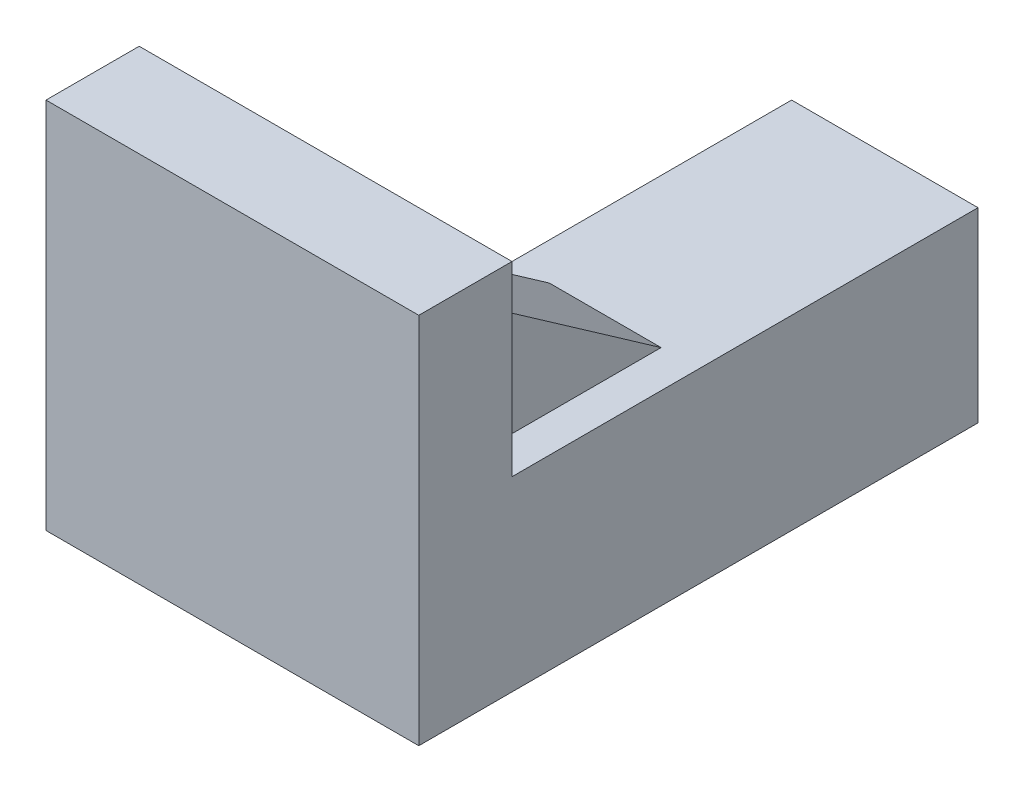
ISO-10303-21;
HEADER;
FILE_DESCRIPTION(('STEP AP214'),'2;1');
FILE_NAME('part.step','',(''),(''),'','','');
FILE_SCHEMA(('AUTOMOTIVE_DESIGN { 1 0 10303 214 1 1 1 1 }'));
ENDSEC;
DATA;
#1=APPLICATION_CONTEXT('core data for automotive mechanical design processes');
#2=APPLICATION_PROTOCOL_DEFINITION('international standard','automotive_design',2000,#1);
#3=PRODUCT_CONTEXT('',#1,'mechanical');
#4=PRODUCT('Part','Part','',(#3));
#5=PRODUCT_RELATED_PRODUCT_CATEGORY('part','',(#4));
#6=PRODUCT_DEFINITION_FORMATION('','',#4);
#7=PRODUCT_DEFINITION_CONTEXT('part definition',#1,'design');
#8=PRODUCT_DEFINITION('design','',#6,#7);
#9=PRODUCT_DEFINITION_SHAPE('','',#8);
#10=(LENGTH_UNIT() NAMED_UNIT(*) SI_UNIT(.MILLI.,.METRE.));
#11=(NAMED_UNIT(*) PLANE_ANGLE_UNIT() SI_UNIT($,.RADIAN.));
#12=(NAMED_UNIT(*) SI_UNIT($,.STERADIAN.) SOLID_ANGLE_UNIT());
#13=UNCERTAINTY_MEASURE_WITH_UNIT(LENGTH_MEASURE(1.E-05),#10,'distance_accuracy_value','');
#14=(GEOMETRIC_REPRESENTATION_CONTEXT(3) GLOBAL_UNCERTAINTY_ASSIGNED_CONTEXT((#13)) GLOBAL_UNIT_ASSIGNED_CONTEXT((#10,
#11,#12)) REPRESENTATION_CONTEXT('',''));
#15=CARTESIAN_POINT('',(0.,0.,0.));
#16=DIRECTION('',(0.,0.,1.));
#17=DIRECTION('',(1.,0.,0.));
#18=AXIS2_PLACEMENT_3D('',#15,#16,#17);
#19=CARTESIAN_POINT('',(0.,0.,25.));
#20=DIRECTION('',(1.,0.,0.));
#21=DIRECTION('',(0.,0.,-1.));
#22=AXIS2_PLACEMENT_3D('',#19,#20,#21);
#23=PLANE('',#22);
#24=DIRECTION('',(0.,0.,1.));
#25=VECTOR('',#24,1.);
#26=CARTESIAN_POINT('',(0.,2.,15.));
#27=LINE('',#26,#25);
#28=CARTESIAN_POINT('',(0.,2.,15.));
#29=VERTEX_POINT('',#28);
#30=CARTESIAN_POINT('',(0.,2.,25.));
#31=VERTEX_POINT('',#30);
#32=EDGE_CURVE('E59',#29,#31,#27,.T.);
#33=ORIENTED_EDGE('',*,*,#32,.F.);
#34=DIRECTION('',(0.,-1.,0.));
#35=VECTOR('',#34,1.);
#36=CARTESIAN_POINT('',(0.,0.,15.));
#37=LINE('',#36,#35);
#38=CARTESIAN_POINT('',(0.,8.,15.));
#39=VERTEX_POINT('',#38);
#40=EDGE_CURVE('E158',#39,#29,#37,.T.);
#41=ORIENTED_EDGE('',*,*,#40,.F.);
#42=DIRECTION('',(0.,0.,1.));
#43=VECTOR('',#42,1.);
#44=CARTESIAN_POINT('',(0.,8.,15.));
#45=LINE('',#44,#43);
#46=CARTESIAN_POINT('',(0.,8.,25.));
#47=VERTEX_POINT('',#46);
#48=EDGE_CURVE('E166',#39,#47,#45,.T.);
#49=ORIENTED_EDGE('',*,*,#48,.T.);
#50=DIRECTION('',(0.,-1.,0.));
#51=VECTOR('',#50,1.);
#52=CARTESIAN_POINT('',(0.,0.,25.));
#53=LINE('',#52,#51);
#54=CARTESIAN_POINT('',(0.,10.,25.));
#55=VERTEX_POINT('',#54);
#56=EDGE_CURVE('E203',#55,#47,#53,.T.);
#57=ORIENTED_EDGE('',*,*,#56,.F.);
#58=DIRECTION('',(0.,0.,-1.));
#59=VECTOR('',#58,1.);
#60=CARTESIAN_POINT('',(0.,10.,25.));
#61=LINE('',#60,#59);
#62=CARTESIAN_POINT('',(0.,10.,0.));
#63=VERTEX_POINT('',#62);
#64=EDGE_CURVE('E210',#55,#63,#61,.T.);
#65=ORIENTED_EDGE('',*,*,#64,.T.);
#66=DIRECTION('',(0.,-1.,0.));
#67=VECTOR('',#66,1.);
#68=CARTESIAN_POINT('',(0.,0.,0.));
#69=LINE('',#68,#67);
#70=CARTESIAN_POINT('',(0.,0.,0.));
#71=VERTEX_POINT('',#70);
#72=EDGE_CURVE('E200',#63,#71,#69,.T.);
#73=ORIENTED_EDGE('',*,*,#72,.T.);
#74=DIRECTION('',(0.,0.,-1.));
#75=VECTOR('',#74,1.);
#76=CARTESIAN_POINT('',(0.,0.,25.));
#77=LINE('',#76,#75);
#78=CARTESIAN_POINT('',(0.,0.,25.));
#79=VERTEX_POINT('',#78);
#80=EDGE_CURVE('E11',#79,#71,#77,.T.);
#81=ORIENTED_EDGE('',*,*,#80,.F.);
#82=EDGE_CURVE('E206',#31,#79,#53,.T.);
#83=ORIENTED_EDGE('',*,*,#82,.F.);
#84=EDGE_LOOP('',(#33,#41,#49,#57,#65,#73,#81,#83));
#85=FACE_BOUND('',#84,.T.);
#86=ADVANCED_FACE('F37',(#85),#23,.F.);
#87=CARTESIAN_POINT('',(0.,0.,25.));
#88=DIRECTION('',(0.,0.,1.));
#89=DIRECTION('',(1.,0.,0.));
#90=AXIS2_PLACEMENT_3D('',#87,#88,#89);
#91=PLANE('',#90);
#92=DIRECTION('',(0.,-1.,0.));
#93=VECTOR('',#92,1.);
#94=CARTESIAN_POINT('',(8.,0.,25.));
#95=LINE('',#94,#93);
#96=CARTESIAN_POINT('',(8.,17.,25.));
#97=VERTEX_POINT('',#96);
#98=CARTESIAN_POINT('',(8.,10.,25.));
#99=VERTEX_POINT('',#98);
#100=EDGE_CURVE('E139',#97,#99,#95,.T.);
#101=ORIENTED_EDGE('',*,*,#100,.F.);
#102=DIRECTION('',(-1.,0.,0.));
#103=VECTOR('',#102,1.);
#104=CARTESIAN_POINT('',(0.,17.,25.));
#105=LINE('',#104,#103);
#106=CARTESIAN_POINT('',(2.,17.,25.));
#107=VERTEX_POINT('',#106);
#108=EDGE_CURVE('E247',#97,#107,#105,.T.);
#109=ORIENTED_EDGE('',*,*,#108,.T.);
#110=DIRECTION('',(0.,-1.,0.));
#111=VECTOR('',#110,1.);
#112=CARTESIAN_POINT('',(2.,0.,25.));
#113=LINE('',#112,#111);
#114=CARTESIAN_POINT('',(2.,10.,25.));
#115=VERTEX_POINT('',#114);
#116=EDGE_CURVE('E144',#107,#115,#113,.T.);
#117=ORIENTED_EDGE('',*,*,#116,.T.);
#118=DIRECTION('',(-1.,0.,0.));
#119=VECTOR('',#118,1.);
#120=CARTESIAN_POINT('',(0.,10.,25.));
#121=LINE('',#120,#119);
#122=EDGE_CURVE('E150',#115,#55,#121,.T.);
#123=ORIENTED_EDGE('',*,*,#122,.T.);
#124=ORIENTED_EDGE('',*,*,#56,.T.);
#125=DIRECTION('',(1.,0.,0.));
#126=VECTOR('',#125,1.);
#127=CARTESIAN_POINT('',(0.,8.,25.));
#128=LINE('',#127,#126);
#129=CARTESIAN_POINT('',(-7.,8.,25.));
#130=VERTEX_POINT('',#129);
#131=EDGE_CURVE('E162',#130,#47,#128,.T.);
#132=ORIENTED_EDGE('',*,*,#131,.F.);
#133=DIRECTION('',(0.,1.,0.));
#134=VECTOR('',#133,1.);
#135=CARTESIAN_POINT('',(-7.,0.,25.));
#136=LINE('',#135,#134);
#137=CARTESIAN_POINT('',(-7.,2.,25.));
#138=VERTEX_POINT('',#137);
#139=EDGE_CURVE('E153',#138,#130,#136,.T.);
#140=ORIENTED_EDGE('',*,*,#139,.F.);
#141=DIRECTION('',(1.,0.,0.));
#142=VECTOR('',#141,1.);
#143=CARTESIAN_POINT('',(0.,2.,25.));
#144=LINE('',#143,#142);
#145=EDGE_CURVE('E160',#138,#31,#144,.T.);
#146=ORIENTED_EDGE('',*,*,#145,.T.);
#147=ORIENTED_EDGE('',*,*,#82,.T.);
#148=DIRECTION('',(1.,0.,0.));
#149=VECTOR('',#148,1.);
#150=CARTESIAN_POINT('',(10.,0.,25.));
#151=LINE('',#150,#149);
#152=CARTESIAN_POINT('',(-10.,0.,25.));
#153=VERTEX_POINT('',#152);
#154=EDGE_CURVE('E174',#153,#79,#151,.T.);
#155=ORIENTED_EDGE('',*,*,#154,.F.);
#156=DIRECTION('',(0.,-1.,0.));
#157=VECTOR('',#156,1.);
#158=CARTESIAN_POINT('',(-10.,0.,25.));
#159=LINE('',#158,#157);
#160=CARTESIAN_POINT('',(-10.,20.,25.));
#161=VERTEX_POINT('',#160);
#162=EDGE_CURVE('E185',#161,#153,#159,.T.);
#163=ORIENTED_EDGE('',*,*,#162,.F.);
#164=DIRECTION('',(-1.,0.,0.));
#165=VECTOR('',#164,1.);
#166=CARTESIAN_POINT('',(10.,20.,25.));
#167=LINE('',#166,#165);
#168=CARTESIAN_POINT('',(10.,20.,25.));
#169=VERTEX_POINT('',#168);
#170=EDGE_CURVE('E183',#169,#161,#167,.T.);
#171=ORIENTED_EDGE('',*,*,#170,.F.);
#172=DIRECTION('',(0.,1.,0.));
#173=VECTOR('',#172,1.);
#174=CARTESIAN_POINT('',(10.,0.,25.));
#175=LINE('',#174,#173);
#176=CARTESIAN_POINT('',(10.,10.,25.));
#177=VERTEX_POINT('',#176);
#178=EDGE_CURVE('E169',#177,#169,#175,.T.);
#179=ORIENTED_EDGE('',*,*,#178,.F.);
#180=EDGE_CURVE('E207',#177,#99,#121,.T.);
#181=ORIENTED_EDGE('',*,*,#180,.T.);
#182=EDGE_LOOP('',(#101,#109,#117,#123,#124,#132,#140,#146,#147,#155,#163,#171,#179,#181));
#183=FACE_BOUND('',#182,.T.);
#184=ADVANCED_FACE('F245',(#183),#91,.F.);
#185=CARTESIAN_POINT('',(0.,0.,25.));
#186=DIRECTION('',(0.,1.,0.));
#187=DIRECTION('',(0.,0.,1.));
#188=AXIS2_PLACEMENT_3D('',#185,#186,#187);
#189=PLANE('',#188);
#190=DIRECTION('',(1.,0.,0.));
#191=VECTOR('',#190,1.);
#192=CARTESIAN_POINT('',(0.,0.,0.));
#193=LINE('',#192,#191);
#194=CARTESIAN_POINT('',(10.,0.,0.));
#195=VERTEX_POINT('',#194);
#196=EDGE_CURVE('E213',#71,#195,#193,.T.);
#197=ORIENTED_EDGE('',*,*,#196,.T.);
#198=DIRECTION('',(0.,0.,-1.));
#199=VECTOR('',#198,1.);
#200=CARTESIAN_POINT('',(10.,0.,25.));
#201=LINE('',#200,#199);
#202=CARTESIAN_POINT('',(10.,0.,30.));
#203=VERTEX_POINT('',#202);
#204=EDGE_CURVE('E44',#203,#195,#201,.T.);
#205=ORIENTED_EDGE('',*,*,#204,.F.);
#206=DIRECTION('',(1.,0.,0.));
#207=VECTOR('',#206,1.);
#208=CARTESIAN_POINT('',(10.,0.,30.));
#209=LINE('',#208,#207);
#210=CARTESIAN_POINT('',(-10.,0.,30.));
#211=VERTEX_POINT('',#210);
#212=EDGE_CURVE('E178',#211,#203,#209,.T.);
#213=ORIENTED_EDGE('',*,*,#212,.F.);
#214=DIRECTION('',(0.,0.,-1.));
#215=VECTOR('',#214,1.);
#216=CARTESIAN_POINT('',(-10.,0.,30.));
#217=LINE('',#216,#215);
#218=EDGE_CURVE('E181',#211,#153,#217,.T.);
#219=ORIENTED_EDGE('',*,*,#218,.T.);
#220=ORIENTED_EDGE('',*,*,#154,.T.);
#221=ORIENTED_EDGE('',*,*,#80,.T.);
#222=EDGE_LOOP('',(#197,#205,#213,#219,#220,#221));
#223=FACE_BOUND('',#222,.T.);
#224=ADVANCED_FACE('F266',(#223),#189,.F.);
#225=CARTESIAN_POINT('',(10.,0.,25.));
#226=DIRECTION('',(-1.,0.,0.));
#227=DIRECTION('',(0.,0.,1.));
#228=AXIS2_PLACEMENT_3D('',#225,#226,#227);
#229=PLANE('',#228);
#230=DIRECTION('',(0.,1.,0.));
#231=VECTOR('',#230,1.);
#232=CARTESIAN_POINT('',(10.,0.,0.));
#233=LINE('',#232,#231);
#234=CARTESIAN_POINT('',(10.,10.,0.));
#235=VERTEX_POINT('',#234);
#236=EDGE_CURVE('E215',#195,#235,#233,.T.);
#237=ORIENTED_EDGE('',*,*,#236,.T.);
#238=DIRECTION('',(0.,0.,-1.));
#239=VECTOR('',#238,1.);
#240=CARTESIAN_POINT('',(10.,10.,25.));
#241=LINE('',#240,#239);
#242=EDGE_CURVE('E222',#177,#235,#241,.T.);
#243=ORIENTED_EDGE('',*,*,#242,.F.);
#244=ORIENTED_EDGE('',*,*,#178,.T.);
#245=DIRECTION('',(0.,0.,-1.));
#246=VECTOR('',#245,1.);
#247=CARTESIAN_POINT('',(10.,20.,30.));
#248=LINE('',#247,#246);
#249=CARTESIAN_POINT('',(10.,20.,30.));
#250=VERTEX_POINT('',#249);
#251=EDGE_CURVE('E193',#250,#169,#248,.T.);
#252=ORIENTED_EDGE('',*,*,#251,.F.);
#253=DIRECTION('',(0.,1.,0.));
#254=VECTOR('',#253,1.);
#255=CARTESIAN_POINT('',(10.,0.,30.));
#256=LINE('',#255,#254);
#257=EDGE_CURVE('E170',#203,#250,#256,.T.);
#258=ORIENTED_EDGE('',*,*,#257,.F.);
#259=ORIENTED_EDGE('',*,*,#204,.T.);
#260=EDGE_LOOP('',(#237,#243,#244,#252,#258,#259));
#261=FACE_BOUND('',#260,.T.);
#262=ADVANCED_FACE('F227',(#261),#229,.F.);
#263=CARTESIAN_POINT('',(0.,10.,25.));
#264=DIRECTION('',(0.,-1.,0.));
#265=DIRECTION('',(0.,0.,-1.));
#266=AXIS2_PLACEMENT_3D('',#263,#264,#265);
#267=PLANE('',#266);
#268=ORIENTED_EDGE('',*,*,#242,.T.);
#269=DIRECTION('',(-1.,0.,0.));
#270=VECTOR('',#269,1.);
#271=CARTESIAN_POINT('',(0.,10.,0.));
#272=LINE('',#271,#270);
#273=EDGE_CURVE('E218',#235,#63,#272,.T.);
#274=ORIENTED_EDGE('',*,*,#273,.T.);
#275=ORIENTED_EDGE('',*,*,#64,.F.);
#276=ORIENTED_EDGE('',*,*,#122,.F.);
#277=DIRECTION('',(0.,0.,1.));
#278=VECTOR('',#277,1.);
#279=CARTESIAN_POINT('',(2.,10.,15.));
#280=LINE('',#279,#278);
#281=CARTESIAN_POINT('',(2.,10.,15.));
#282=VERTEX_POINT('',#281);
#283=EDGE_CURVE('E138',#282,#115,#280,.T.);
#284=ORIENTED_EDGE('',*,*,#283,.F.);
#285=DIRECTION('',(-1.,0.,0.));
#286=VECTOR('',#285,1.);
#287=CARTESIAN_POINT('',(0.,10.,15.));
#288=LINE('',#287,#286);
#289=CARTESIAN_POINT('',(8.,10.,15.));
#290=VERTEX_POINT('',#289);
#291=EDGE_CURVE('E130',#290,#282,#288,.T.);
#292=ORIENTED_EDGE('',*,*,#291,.F.);
#293=DIRECTION('',(0.,0.,1.));
#294=VECTOR('',#293,1.);
#295=CARTESIAN_POINT('',(8.,10.,15.));
#296=LINE('',#295,#294);
#297=EDGE_CURVE('E151',#290,#99,#296,.T.);
#298=ORIENTED_EDGE('',*,*,#297,.T.);
#299=ORIENTED_EDGE('',*,*,#180,.F.);
#300=EDGE_LOOP('',(#268,#274,#275,#276,#284,#292,#298,#299));
#301=FACE_BOUND('',#300,.T.);
#302=ADVANCED_FACE('F148',(#301),#267,.F.);
#303=CARTESIAN_POINT('',(0.,0.,0.));
#304=DIRECTION('',(0.,0.,-1.));
#305=DIRECTION('',(-1.,0.,0.));
#306=AXIS2_PLACEMENT_3D('',#303,#304,#305);
#307=PLANE('',#306);
#308=CARTESIAN_POINT('',(5.70710678118655,4.29289321881345,0.));
#309=DIRECTION('',(0.,0.,-1.));
#310=DIRECTION('',(-1.,0.,0.));
#311=AXIS2_PLACEMENT_3D('',#308,#309,#310);
#312=CIRCLE('',#311,1.5);
#313=CARTESIAN_POINT('',(4.20710678118655,4.29289321881345,0.));
#314=VERTEX_POINT('',#313);
#315=EDGE_CURVE('E196',#314,#314,#312,.T.);
#316=ORIENTED_EDGE('',*,*,#315,.F.);
#317=EDGE_LOOP('',(#316));
#318=FACE_BOUND('',#317,.T.);
#319=ORIENTED_EDGE('',*,*,#72,.F.);
#320=ORIENTED_EDGE('',*,*,#273,.F.);
#321=ORIENTED_EDGE('',*,*,#236,.F.);
#322=ORIENTED_EDGE('',*,*,#196,.F.);
#323=EDGE_LOOP('',(#319,#320,#321,#322));
#324=FACE_BOUND('',#323,.T.);
#325=ADVANCED_FACE('F235',(#318,#324),#307,.T.);
#326=CARTESIAN_POINT('',(5.70710678118655,4.29289321881345,15.));
#327=DIRECTION('',(0.,0.,-1.));
#328=DIRECTION('',(-1.,0.,0.));
#329=AXIS2_PLACEMENT_3D('',#326,#327,#328);
#330=CYLINDRICAL_SURFACE('',#329,1.5);
#331=CARTESIAN_POINT('',(5.70710678118655,4.29289321881345,15.));
#332=DIRECTION('',(0.,0.,-1.));
#333=DIRECTION('',(-1.,0.,0.));
#334=AXIS2_PLACEMENT_3D('',#331,#332,#333);
#335=CIRCLE('',#334,1.5);
#336=CARTESIAN_POINT('',(4.20710678118655,4.29289321881345,15.));
#337=VERTEX_POINT('',#336);
#338=EDGE_CURVE('E197',#337,#337,#335,.T.);
#339=ORIENTED_EDGE('',*,*,#338,.F.);
#340=EDGE_LOOP('',(#339));
#341=FACE_BOUND('',#340,.T.);
#342=ORIENTED_EDGE('',*,*,#315,.T.);
#343=EDGE_LOOP('',(#342));
#344=FACE_BOUND('',#343,.T.);
#345=ADVANCED_FACE('F302',(#341,#344),#330,.F.);
#346=CARTESIAN_POINT('',(5.70710678118655,4.29289321881345,15.));
#347=DIRECTION('',(0.,0.,-1.));
#348=DIRECTION('',(-1.,0.,0.));
#349=AXIS2_PLACEMENT_3D('',#346,#347,#348);
#350=PLANE('',#349);
#351=ORIENTED_EDGE('',*,*,#338,.T.);
#352=EDGE_LOOP('',(#351));
#353=FACE_BOUND('',#352,.T.);
#354=ADVANCED_FACE('F299',(#353),#350,.T.);
#355=CARTESIAN_POINT('',(10.,20.,30.));
#356=DIRECTION('',(0.,-1.,0.));
#357=DIRECTION('',(0.,0.,-1.));
#358=AXIS2_PLACEMENT_3D('',#355,#356,#357);
#359=PLANE('',#358);
#360=ORIENTED_EDGE('',*,*,#170,.T.);
#361=DIRECTION('',(0.,0.,-1.));
#362=VECTOR('',#361,1.);
#363=CARTESIAN_POINT('',(-10.,20.,30.));
#364=LINE('',#363,#362);
#365=CARTESIAN_POINT('',(-10.,20.,30.));
#366=VERTEX_POINT('',#365);
#367=EDGE_CURVE('E190',#366,#161,#364,.T.);
#368=ORIENTED_EDGE('',*,*,#367,.F.);
#369=DIRECTION('',(-1.,0.,0.));
#370=VECTOR('',#369,1.);
#371=CARTESIAN_POINT('',(10.,20.,30.));
#372=LINE('',#371,#370);
#373=EDGE_CURVE('E173',#250,#366,#372,.T.);
#374=ORIENTED_EDGE('',*,*,#373,.F.);
#375=ORIENTED_EDGE('',*,*,#251,.T.);
#376=EDGE_LOOP('',(#360,#368,#374,#375));
#377=FACE_BOUND('',#376,.T.);
#378=ADVANCED_FACE('F260',(#377),#359,.F.);
#379=CARTESIAN_POINT('',(-10.,0.,30.));
#380=DIRECTION('',(1.,0.,0.));
#381=DIRECTION('',(0.,0.,-1.));
#382=AXIS2_PLACEMENT_3D('',#379,#380,#381);
#383=PLANE('',#382);
#384=ORIENTED_EDGE('',*,*,#162,.T.);
#385=ORIENTED_EDGE('',*,*,#218,.F.);
#386=DIRECTION('',(0.,-1.,0.));
#387=VECTOR('',#386,1.);
#388=CARTESIAN_POINT('',(-10.,0.,30.));
#389=LINE('',#388,#387);
#390=EDGE_CURVE('E176',#366,#211,#389,.T.);
#391=ORIENTED_EDGE('',*,*,#390,.F.);
#392=ORIENTED_EDGE('',*,*,#367,.T.);
#393=EDGE_LOOP('',(#384,#385,#391,#392));
#394=FACE_BOUND('',#393,.T.);
#395=ADVANCED_FACE('F284',(#394),#383,.F.);
#396=CARTESIAN_POINT('',(0.,0.,30.));
#397=DIRECTION('',(0.,0.,1.));
#398=DIRECTION('',(1.,0.,0.));
#399=AXIS2_PLACEMENT_3D('',#396,#397,#398);
#400=PLANE('',#399);
#401=ORIENTED_EDGE('',*,*,#257,.T.);
#402=ORIENTED_EDGE('',*,*,#373,.T.);
#403=ORIENTED_EDGE('',*,*,#390,.T.);
#404=ORIENTED_EDGE('',*,*,#212,.T.);
#405=EDGE_LOOP('',(#401,#402,#403,#404));
#406=FACE_BOUND('',#405,.T.);
#407=ADVANCED_FACE('F264',(#406),#400,.T.);
#408=CARTESIAN_POINT('',(0.,8.,15.));
#409=DIRECTION('',(0.,-1.,0.));
#410=DIRECTION('',(0.,0.,-1.));
#411=AXIS2_PLACEMENT_3D('',#408,#409,#410);
#412=PLANE('',#411);
#413=ORIENTED_EDGE('',*,*,#48,.F.);
#414=DIRECTION('',(0.573462344363328,0.,-0.81923192051904));
#415=VECTOR('',#414,1.);
#416=CARTESIAN_POINT('',(-7.,8.,25.));
#417=LINE('',#416,#415);
#418=EDGE_CURVE('E250',#130,#39,#417,.T.);
#419=ORIENTED_EDGE('',*,*,#418,.F.);
#420=ORIENTED_EDGE('',*,*,#131,.T.);
#421=EDGE_LOOP('',(#413,#419,#420));
#422=FACE_BOUND('',#421,.T.);
#423=ADVANCED_FACE('F276',(#422),#412,.F.);
#424=CARTESIAN_POINT('',(0.,2.,15.));
#425=DIRECTION('',(0.,-1.,0.));
#426=DIRECTION('',(0.,0.,-1.));
#427=AXIS2_PLACEMENT_3D('',#424,#425,#426);
#428=PLANE('',#427);
#429=DIRECTION('',(-0.573462344363328,0.,0.81923192051904));
#430=VECTOR('',#429,1.);
#431=CARTESIAN_POINT('',(0.,2.,15.));
#432=LINE('',#431,#430);
#433=EDGE_CURVE('E248',#29,#138,#432,.T.);
#434=ORIENTED_EDGE('',*,*,#433,.F.);
#435=ORIENTED_EDGE('',*,*,#32,.T.);
#436=ORIENTED_EDGE('',*,*,#145,.F.);
#437=EDGE_LOOP('',(#434,#435,#436));
#438=FACE_BOUND('',#437,.T.);
#439=ADVANCED_FACE('F274',(#438),#428,.T.);
#440=CARTESIAN_POINT('',(2.,0.,15.));
#441=DIRECTION('',(-1.,0.,0.));
#442=DIRECTION('',(0.,0.,1.));
#443=AXIS2_PLACEMENT_3D('',#440,#441,#442);
#444=PLANE('',#443);
#445=DIRECTION('',(0.,0.573462344363328,0.81923192051904));
#446=VECTOR('',#445,1.);
#447=CARTESIAN_POINT('',(2.,10.,15.));
#448=LINE('',#447,#446);
#449=EDGE_CURVE('E133',#282,#107,#448,.T.);
#450=ORIENTED_EDGE('',*,*,#449,.F.);
#451=ORIENTED_EDGE('',*,*,#283,.T.);
#452=ORIENTED_EDGE('',*,*,#116,.F.);
#453=EDGE_LOOP('',(#450,#451,#452));
#454=FACE_BOUND('',#453,.T.);
#455=ADVANCED_FACE('F142',(#454),#444,.T.);
#456=CARTESIAN_POINT('',(8.,0.,15.));
#457=DIRECTION('',(-1.,0.,0.));
#458=DIRECTION('',(0.,0.,1.));
#459=AXIS2_PLACEMENT_3D('',#456,#457,#458);
#460=PLANE('',#459);
#461=ORIENTED_EDGE('',*,*,#297,.F.);
#462=DIRECTION('',(0.,0.573462344363328,0.81923192051904));
#463=VECTOR('',#462,1.);
#464=CARTESIAN_POINT('',(8.,6.71140939597315,10.3020134228188));
#465=LINE('',#464,#463);
#466=EDGE_CURVE('E51',#290,#97,#465,.T.);
#467=ORIENTED_EDGE('',*,*,#466,.T.);
#468=ORIENTED_EDGE('',*,*,#100,.T.);
#469=EDGE_LOOP('',(#461,#467,#468));
#470=FACE_BOUND('',#469,.T.);
#471=ADVANCED_FACE('F255',(#470),#460,.F.);
#472=CARTESIAN_POINT('',(-7.,-2.,25.));
#473=DIRECTION('',(0.81923192051904,0.,0.573462344363328));
#474=DIRECTION('',(0.573462344363328,0.,-0.81923192051904));
#475=AXIS2_PLACEMENT_3D('',#472,#473,#474);
#476=PLANE('',#475);
#477=ORIENTED_EDGE('',*,*,#433,.T.);
#478=ORIENTED_EDGE('',*,*,#139,.T.);
#479=ORIENTED_EDGE('',*,*,#418,.T.);
#480=ORIENTED_EDGE('',*,*,#40,.T.);
#481=EDGE_LOOP('',(#477,#478,#479,#480));
#482=FACE_BOUND('',#481,.T.);
#483=ADVANCED_FACE('F272',(#482),#476,.F.);
#484=CARTESIAN_POINT('',(12.,10.,15.));
#485=DIRECTION('',(0.,-0.81923192051904,0.573462344363328));
#486=DIRECTION('',(0.,-0.573462344363328,-0.81923192051904));
#487=AXIS2_PLACEMENT_3D('',#484,#485,#486);
#488=PLANE('',#487);
#489=ORIENTED_EDGE('',*,*,#291,.T.);
#490=ORIENTED_EDGE('',*,*,#449,.T.);
#491=ORIENTED_EDGE('',*,*,#108,.F.);
#492=ORIENTED_EDGE('',*,*,#466,.F.);
#493=EDGE_LOOP('',(#489,#490,#491,#492));
#494=FACE_BOUND('',#493,.T.);
#495=ADVANCED_FACE('F132',(#494),#488,.F.);
#496=CLOSED_SHELL('',(#86,#184,#224,#262,#302,#325,#345,#354,#378,#395,#407,#423,#439,#455,#471,
#483,#495));
#497=MANIFOLD_SOLID_BREP('B2',#496);
#498=ADVANCED_BREP_SHAPE_REPRESENTATION('',(#18,#497),#14);
#499=SHAPE_DEFINITION_REPRESENTATION(#9,#498);
ENDSEC;
END-ISO-10303-21;
